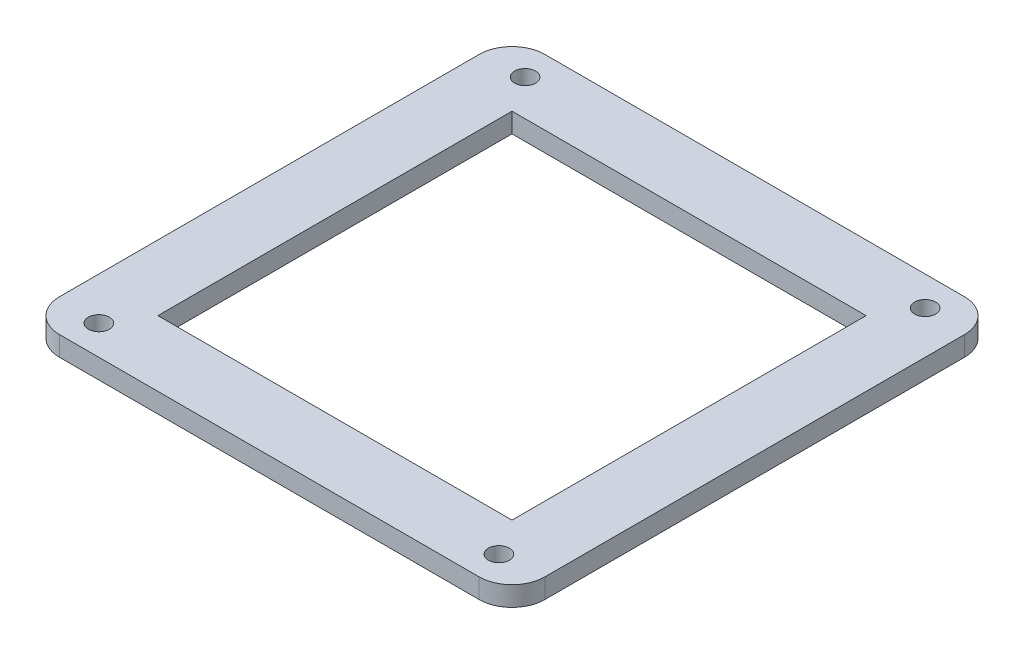
ISO-10303-21;
HEADER;
FILE_DESCRIPTION(('STEP AP214'),'2;1');
FILE_NAME('part.step','',(''),(''),'','','');
FILE_SCHEMA(('AUTOMOTIVE_DESIGN { 1 0 10303 214 1 1 1 1 }'));
ENDSEC;
DATA;
#1=APPLICATION_CONTEXT('core data for automotive mechanical design processes');
#2=APPLICATION_PROTOCOL_DEFINITION('international standard','automotive_design',2000,#1);
#3=PRODUCT_CONTEXT('',#1,'mechanical');
#4=PRODUCT('Part','Part','',(#3));
#5=PRODUCT_RELATED_PRODUCT_CATEGORY('part','',(#4));
#6=PRODUCT_DEFINITION_FORMATION('','',#4);
#7=PRODUCT_DEFINITION_CONTEXT('part definition',#1,'design');
#8=PRODUCT_DEFINITION('design','',#6,#7);
#9=PRODUCT_DEFINITION_SHAPE('','',#8);
#10=(LENGTH_UNIT() NAMED_UNIT(*) SI_UNIT(.MILLI.,.METRE.));
#11=(NAMED_UNIT(*) PLANE_ANGLE_UNIT() SI_UNIT($,.RADIAN.));
#12=(NAMED_UNIT(*) SI_UNIT($,.STERADIAN.) SOLID_ANGLE_UNIT());
#13=UNCERTAINTY_MEASURE_WITH_UNIT(LENGTH_MEASURE(1.E-05),#10,'distance_accuracy_value','');
#14=(GEOMETRIC_REPRESENTATION_CONTEXT(3) GLOBAL_UNCERTAINTY_ASSIGNED_CONTEXT((#13)) GLOBAL_UNIT_ASSIGNED_CONTEXT((#10,
#11,#12)) REPRESENTATION_CONTEXT('',''));
#15=CARTESIAN_POINT('',(0.,0.,0.));
#16=DIRECTION('',(0.,0.,1.));
#17=DIRECTION('',(1.,0.,0.));
#18=AXIS2_PLACEMENT_3D('',#15,#16,#17);
#19=CARTESIAN_POINT('',(0.,3.,0.));
#20=DIRECTION('',(0.,-1.,0.));
#21=DIRECTION('',(0.,0.,-1.));
#22=AXIS2_PLACEMENT_3D('',#19,#20,#21);
#23=PLANE('',#22);
#24=CARTESIAN_POINT('',(-30.5,3.,-32.5));
#25=DIRECTION('',(0.,1.,0.));
#26=DIRECTION('',(0.,0.,1.));
#27=AXIS2_PLACEMENT_3D('',#24,#25,#26);
#28=CIRCLE('',#27,1.6);
#29=CARTESIAN_POINT('',(-30.5,3.,-30.9));
#30=VERTEX_POINT('',#29);
#31=EDGE_CURVE('E417',#30,#30,#28,.T.);
#32=ORIENTED_EDGE('',*,*,#31,.F.);
#33=EDGE_LOOP('',(#32));
#34=FACE_BOUND('',#33,.T.);
#35=CARTESIAN_POINT('',(30.5,3.,-32.5));
#36=DIRECTION('',(0.,1.,0.));
#37=DIRECTION('',(0.,0.,1.));
#38=AXIS2_PLACEMENT_3D('',#35,#36,#37);
#39=CIRCLE('',#38,1.6);
#40=CARTESIAN_POINT('',(30.5,3.,-30.9));
#41=VERTEX_POINT('',#40);
#42=EDGE_CURVE('E419',#41,#41,#39,.T.);
#43=ORIENTED_EDGE('',*,*,#42,.F.);
#44=EDGE_LOOP('',(#43));
#45=FACE_BOUND('',#44,.T.);
#46=CARTESIAN_POINT('',(30.5,3.,32.5));
#47=DIRECTION('',(0.,1.,0.));
#48=DIRECTION('',(0.,0.,1.));
#49=AXIS2_PLACEMENT_3D('',#46,#47,#48);
#50=CIRCLE('',#49,1.6);
#51=CARTESIAN_POINT('',(30.5,3.,34.1));
#52=VERTEX_POINT('',#51);
#53=EDGE_CURVE('E191',#52,#52,#50,.T.);
#54=ORIENTED_EDGE('',*,*,#53,.F.);
#55=EDGE_LOOP('',(#54));
#56=FACE_BOUND('',#55,.T.);
#57=CARTESIAN_POINT('',(-30.5,3.,32.5));
#58=DIRECTION('',(0.,1.,0.));
#59=DIRECTION('',(0.,0.,1.));
#60=AXIS2_PLACEMENT_3D('',#57,#58,#59);
#61=CIRCLE('',#60,1.6);
#62=CARTESIAN_POINT('',(-30.5,3.,34.1));
#63=VERTEX_POINT('',#62);
#64=EDGE_CURVE('E190',#63,#63,#61,.T.);
#65=ORIENTED_EDGE('',*,*,#64,.F.);
#66=EDGE_LOOP('',(#65));
#67=FACE_BOUND('',#66,.T.);
#68=DIRECTION('',(0.,0.,1.));
#69=VECTOR('',#68,1.);
#70=CARTESIAN_POINT('',(-37.,3.,37.));
#71=LINE('',#70,#69);
#72=CARTESIAN_POINT('',(-37.,3.,-32.));
#73=VERTEX_POINT('',#72);
#74=CARTESIAN_POINT('',(-37.,3.,32.));
#75=VERTEX_POINT('',#74);
#76=EDGE_CURVE('E171',#73,#75,#71,.T.);
#77=ORIENTED_EDGE('',*,*,#76,.T.);
#78=CARTESIAN_POINT('',(-32.,3.,32.));
#79=DIRECTION('',(0.,-1.,0.));
#80=DIRECTION('',(0.,0.,-1.));
#81=AXIS2_PLACEMENT_3D('',#78,#79,#80);
#82=CIRCLE('',#81,5.);
#83=CARTESIAN_POINT('',(-32.,3.,37.));
#84=VERTEX_POINT('',#83);
#85=EDGE_CURVE('E214',#75,#84,#82,.F.);
#86=ORIENTED_EDGE('',*,*,#85,.T.);
#87=DIRECTION('',(1.,0.,0.));
#88=VECTOR('',#87,1.);
#89=CARTESIAN_POINT('',(-37.,3.,37.));
#90=LINE('',#89,#88);
#91=CARTESIAN_POINT('',(32.,3.,37.));
#92=VERTEX_POINT('',#91);
#93=EDGE_CURVE('E174',#84,#92,#90,.T.);
#94=ORIENTED_EDGE('',*,*,#93,.T.);
#95=CARTESIAN_POINT('',(32.,3.,32.));
#96=DIRECTION('',(0.,-1.,0.));
#97=DIRECTION('',(0.,0.,-1.));
#98=AXIS2_PLACEMENT_3D('',#95,#96,#97);
#99=CIRCLE('',#98,5.);
#100=CARTESIAN_POINT('',(37.,3.,32.));
#101=VERTEX_POINT('',#100);
#102=EDGE_CURVE('E212',#92,#101,#99,.F.);
#103=ORIENTED_EDGE('',*,*,#102,.T.);
#104=DIRECTION('',(0.,0.,-1.));
#105=VECTOR('',#104,1.);
#106=CARTESIAN_POINT('',(37.,3.,37.));
#107=LINE('',#106,#105);
#108=CARTESIAN_POINT('',(37.,3.,-32.));
#109=VERTEX_POINT('',#108);
#110=EDGE_CURVE('E166',#101,#109,#107,.T.);
#111=ORIENTED_EDGE('',*,*,#110,.T.);
#112=CARTESIAN_POINT('',(32.,3.,-32.));
#113=DIRECTION('',(0.,-1.,0.));
#114=DIRECTION('',(0.,0.,-1.));
#115=AXIS2_PLACEMENT_3D('',#112,#113,#114);
#116=CIRCLE('',#115,5.);
#117=CARTESIAN_POINT('',(32.,3.,-37.));
#118=VERTEX_POINT('',#117);
#119=EDGE_CURVE('E53',#109,#118,#116,.F.);
#120=ORIENTED_EDGE('',*,*,#119,.T.);
#121=DIRECTION('',(-1.,0.,0.));
#122=VECTOR('',#121,1.);
#123=CARTESIAN_POINT('',(-37.,3.,-37.));
#124=LINE('',#123,#122);
#125=CARTESIAN_POINT('',(-32.,3.,-37.));
#126=VERTEX_POINT('',#125);
#127=EDGE_CURVE('E168',#118,#126,#124,.T.);
#128=ORIENTED_EDGE('',*,*,#127,.T.);
#129=CARTESIAN_POINT('',(-32.,3.,-32.));
#130=DIRECTION('',(0.,-1.,0.));
#131=DIRECTION('',(0.,0.,-1.));
#132=AXIS2_PLACEMENT_3D('',#129,#130,#131);
#133=CIRCLE('',#132,5.);
#134=EDGE_CURVE('E209',#126,#73,#133,.F.);
#135=ORIENTED_EDGE('',*,*,#134,.T.);
#136=EDGE_LOOP('',(#77,#86,#94,#103,#111,#120,#128,#135));
#137=FACE_BOUND('',#136,.T.);
#138=DIRECTION('',(0.,0.,1.));
#139=VECTOR('',#138,1.);
#140=CARTESIAN_POINT('',(-27.,3.,27.));
#141=LINE('',#140,#139);
#142=CARTESIAN_POINT('',(-27.,3.,-27.));
#143=VERTEX_POINT('',#142);
#144=CARTESIAN_POINT('',(-27.,3.,27.));
#145=VERTEX_POINT('',#144);
#146=EDGE_CURVE('E123',#143,#145,#141,.T.);
#147=ORIENTED_EDGE('',*,*,#146,.F.);
#148=DIRECTION('',(-1.,0.,0.));
#149=VECTOR('',#148,1.);
#150=CARTESIAN_POINT('',(-27.,3.,-27.));
#151=LINE('',#150,#149);
#152=CARTESIAN_POINT('',(27.,3.,-27.));
#153=VERTEX_POINT('',#152);
#154=EDGE_CURVE('E148',#153,#143,#151,.T.);
#155=ORIENTED_EDGE('',*,*,#154,.F.);
#156=DIRECTION('',(0.,0.,-1.));
#157=VECTOR('',#156,1.);
#158=CARTESIAN_POINT('',(27.,3.,27.));
#159=LINE('',#158,#157);
#160=CARTESIAN_POINT('',(27.,3.,27.));
#161=VERTEX_POINT('',#160);
#162=EDGE_CURVE('E146',#161,#153,#159,.T.);
#163=ORIENTED_EDGE('',*,*,#162,.F.);
#164=DIRECTION('',(1.,0.,0.));
#165=VECTOR('',#164,1.);
#166=CARTESIAN_POINT('',(-27.,3.,27.));
#167=LINE('',#166,#165);
#168=EDGE_CURVE('E133',#145,#161,#167,.T.);
#169=ORIENTED_EDGE('',*,*,#168,.F.);
#170=EDGE_LOOP('',(#147,#155,#163,#169));
#171=FACE_BOUND('',#170,.T.);
#172=ADVANCED_FACE('F32',(#34,#45,#56,#67,#137,#171),#23,.F.);
#173=CARTESIAN_POINT('',(0.,0.,0.));
#174=DIRECTION('',(0.,-1.,0.));
#175=DIRECTION('',(0.,0.,-1.));
#176=AXIS2_PLACEMENT_3D('',#173,#174,#175);
#177=PLANE('',#176);
#178=CARTESIAN_POINT('',(-30.5,0.,-32.5));
#179=DIRECTION('',(0.,-1.,0.));
#180=DIRECTION('',(0.,0.,-1.));
#181=AXIS2_PLACEMENT_3D('',#178,#179,#180);
#182=CIRCLE('',#181,1.6);
#183=CARTESIAN_POINT('',(-30.5,0.,-34.1));
#184=VERTEX_POINT('',#183);
#185=EDGE_CURVE('E415',#184,#184,#182,.T.);
#186=ORIENTED_EDGE('',*,*,#185,.F.);
#187=EDGE_LOOP('',(#186));
#188=FACE_BOUND('',#187,.T.);
#189=CARTESIAN_POINT('',(30.5,0.,-32.5));
#190=DIRECTION('',(0.,-1.,0.));
#191=DIRECTION('',(0.,0.,-1.));
#192=AXIS2_PLACEMENT_3D('',#189,#190,#191);
#193=CIRCLE('',#192,1.6);
#194=CARTESIAN_POINT('',(30.5,0.,-34.1));
#195=VERTEX_POINT('',#194);
#196=EDGE_CURVE('E424',#195,#195,#193,.T.);
#197=ORIENTED_EDGE('',*,*,#196,.F.);
#198=EDGE_LOOP('',(#197));
#199=FACE_BOUND('',#198,.T.);
#200=CARTESIAN_POINT('',(30.5,0.,32.5));
#201=DIRECTION('',(0.,-1.,0.));
#202=DIRECTION('',(0.,0.,-1.));
#203=AXIS2_PLACEMENT_3D('',#200,#201,#202);
#204=CIRCLE('',#203,1.6);
#205=CARTESIAN_POINT('',(30.5,0.,30.9));
#206=VERTEX_POINT('',#205);
#207=EDGE_CURVE('E187',#206,#206,#204,.T.);
#208=ORIENTED_EDGE('',*,*,#207,.F.);
#209=EDGE_LOOP('',(#208));
#210=FACE_BOUND('',#209,.T.);
#211=CARTESIAN_POINT('',(-30.5,0.,32.5));
#212=DIRECTION('',(0.,-1.,0.));
#213=DIRECTION('',(0.,0.,-1.));
#214=AXIS2_PLACEMENT_3D('',#211,#212,#213);
#215=CIRCLE('',#214,1.6);
#216=CARTESIAN_POINT('',(-30.5,0.,30.9));
#217=VERTEX_POINT('',#216);
#218=EDGE_CURVE('E155',#217,#217,#215,.T.);
#219=ORIENTED_EDGE('',*,*,#218,.F.);
#220=EDGE_LOOP('',(#219));
#221=FACE_BOUND('',#220,.T.);
#222=DIRECTION('',(1.,0.,0.));
#223=VECTOR('',#222,1.);
#224=CARTESIAN_POINT('',(-37.,0.,37.));
#225=LINE('',#224,#223);
#226=CARTESIAN_POINT('',(-32.,0.,37.));
#227=VERTEX_POINT('',#226);
#228=CARTESIAN_POINT('',(32.,0.,37.));
#229=VERTEX_POINT('',#228);
#230=EDGE_CURVE('E169',#227,#229,#225,.T.);
#231=ORIENTED_EDGE('',*,*,#230,.F.);
#232=CARTESIAN_POINT('',(-32.,0.,32.));
#233=DIRECTION('',(0.,-1.,0.));
#234=DIRECTION('',(0.,0.,-1.));
#235=AXIS2_PLACEMENT_3D('',#232,#233,#234);
#236=CIRCLE('',#235,5.);
#237=CARTESIAN_POINT('',(-37.,0.,32.));
#238=VERTEX_POINT('',#237);
#239=EDGE_CURVE('E202',#227,#238,#236,.T.);
#240=ORIENTED_EDGE('',*,*,#239,.T.);
#241=DIRECTION('',(0.,0.,1.));
#242=VECTOR('',#241,1.);
#243=CARTESIAN_POINT('',(-37.,0.,37.));
#244=LINE('',#243,#242);
#245=CARTESIAN_POINT('',(-37.,0.,-32.));
#246=VERTEX_POINT('',#245);
#247=EDGE_CURVE('E182',#246,#238,#244,.T.);
#248=ORIENTED_EDGE('',*,*,#247,.F.);
#249=CARTESIAN_POINT('',(-32.,0.,-32.));
#250=DIRECTION('',(0.,-1.,0.));
#251=DIRECTION('',(0.,0.,-1.));
#252=AXIS2_PLACEMENT_3D('',#249,#250,#251);
#253=CIRCLE('',#252,5.);
#254=CARTESIAN_POINT('',(-32.,0.,-37.));
#255=VERTEX_POINT('',#254);
#256=EDGE_CURVE('E196',#246,#255,#253,.T.);
#257=ORIENTED_EDGE('',*,*,#256,.T.);
#258=DIRECTION('',(-1.,0.,0.));
#259=VECTOR('',#258,1.);
#260=CARTESIAN_POINT('',(-37.,0.,-37.));
#261=LINE('',#260,#259);
#262=CARTESIAN_POINT('',(32.,0.,-37.));
#263=VERTEX_POINT('',#262);
#264=EDGE_CURVE('E180',#263,#255,#261,.T.);
#265=ORIENTED_EDGE('',*,*,#264,.F.);
#266=CARTESIAN_POINT('',(32.,0.,-32.));
#267=DIRECTION('',(0.,-1.,0.));
#268=DIRECTION('',(0.,0.,-1.));
#269=AXIS2_PLACEMENT_3D('',#266,#267,#268);
#270=CIRCLE('',#269,5.);
#271=CARTESIAN_POINT('',(37.,0.,-32.));
#272=VERTEX_POINT('',#271);
#273=EDGE_CURVE('E198',#263,#272,#270,.T.);
#274=ORIENTED_EDGE('',*,*,#273,.T.);
#275=DIRECTION('',(0.,0.,-1.));
#276=VECTOR('',#275,1.);
#277=CARTESIAN_POINT('',(37.,0.,37.));
#278=LINE('',#277,#276);
#279=CARTESIAN_POINT('',(37.,0.,32.));
#280=VERTEX_POINT('',#279);
#281=EDGE_CURVE('E141',#280,#272,#278,.T.);
#282=ORIENTED_EDGE('',*,*,#281,.F.);
#283=CARTESIAN_POINT('',(32.,0.,32.));
#284=DIRECTION('',(0.,-1.,0.));
#285=DIRECTION('',(0.,0.,-1.));
#286=AXIS2_PLACEMENT_3D('',#283,#284,#285);
#287=CIRCLE('',#286,5.);
#288=EDGE_CURVE('E200',#280,#229,#287,.T.);
#289=ORIENTED_EDGE('',*,*,#288,.T.);
#290=EDGE_LOOP('',(#231,#240,#248,#257,#265,#274,#282,#289));
#291=FACE_BOUND('',#290,.T.);
#292=DIRECTION('',(-1.,0.,0.));
#293=VECTOR('',#292,1.);
#294=CARTESIAN_POINT('',(-27.,0.,-27.));
#295=LINE('',#294,#293);
#296=CARTESIAN_POINT('',(27.,0.,-27.));
#297=VERTEX_POINT('',#296);
#298=CARTESIAN_POINT('',(-27.,0.,-27.));
#299=VERTEX_POINT('',#298);
#300=EDGE_CURVE('E134',#297,#299,#295,.T.);
#301=ORIENTED_EDGE('',*,*,#300,.T.);
#302=DIRECTION('',(0.,0.,1.));
#303=VECTOR('',#302,1.);
#304=CARTESIAN_POINT('',(-27.,0.,27.));
#305=LINE('',#304,#303);
#306=CARTESIAN_POINT('',(-27.,0.,27.));
#307=VERTEX_POINT('',#306);
#308=EDGE_CURVE('E153',#299,#307,#305,.T.);
#309=ORIENTED_EDGE('',*,*,#308,.T.);
#310=DIRECTION('',(1.,0.,0.));
#311=VECTOR('',#310,1.);
#312=CARTESIAN_POINT('',(-27.,0.,27.));
#313=LINE('',#312,#311);
#314=CARTESIAN_POINT('',(27.,0.,27.));
#315=VERTEX_POINT('',#314);
#316=EDGE_CURVE('E140',#307,#315,#313,.T.);
#317=ORIENTED_EDGE('',*,*,#316,.T.);
#318=DIRECTION('',(0.,0.,-1.));
#319=VECTOR('',#318,1.);
#320=CARTESIAN_POINT('',(27.,0.,27.));
#321=LINE('',#320,#319);
#322=EDGE_CURVE('E157',#315,#297,#321,.T.);
#323=ORIENTED_EDGE('',*,*,#322,.T.);
#324=EDGE_LOOP('',(#301,#309,#317,#323));
#325=FACE_BOUND('',#324,.T.);
#326=ADVANCED_FACE('F230',(#188,#199,#210,#221,#291,#325),#177,.T.);
#327=CARTESIAN_POINT('',(37.,3.,37.));
#328=DIRECTION('',(-1.,0.,0.));
#329=DIRECTION('',(0.,0.,1.));
#330=AXIS2_PLACEMENT_3D('',#327,#328,#329);
#331=PLANE('',#330);
#332=ORIENTED_EDGE('',*,*,#110,.F.);
#333=DIRECTION('',(0.,-1.,0.));
#334=VECTOR('',#333,1.);
#335=CARTESIAN_POINT('',(37.,3.,32.));
#336=LINE('',#335,#334);
#337=EDGE_CURVE('E218',#101,#280,#336,.T.);
#338=ORIENTED_EDGE('',*,*,#337,.T.);
#339=ORIENTED_EDGE('',*,*,#281,.T.);
#340=DIRECTION('',(0.,-1.,0.));
#341=VECTOR('',#340,1.);
#342=CARTESIAN_POINT('',(37.,3.,-32.));
#343=LINE('',#342,#341);
#344=EDGE_CURVE('E216',#272,#109,#343,.F.);
#345=ORIENTED_EDGE('',*,*,#344,.T.);
#346=EDGE_LOOP('',(#332,#338,#339,#345));
#347=FACE_BOUND('',#346,.T.);
#348=ADVANCED_FACE('F224',(#347),#331,.F.);
#349=CARTESIAN_POINT('',(-37.,3.,-37.));
#350=DIRECTION('',(0.,0.,1.));
#351=DIRECTION('',(1.,0.,0.));
#352=AXIS2_PLACEMENT_3D('',#349,#350,#351);
#353=PLANE('',#352);
#354=ORIENTED_EDGE('',*,*,#127,.F.);
#355=DIRECTION('',(0.,-1.,0.));
#356=VECTOR('',#355,1.);
#357=CARTESIAN_POINT('',(32.,3.,-37.));
#358=LINE('',#357,#356);
#359=EDGE_CURVE('E11',#118,#263,#358,.T.);
#360=ORIENTED_EDGE('',*,*,#359,.T.);
#361=ORIENTED_EDGE('',*,*,#264,.T.);
#362=DIRECTION('',(0.,-1.,0.));
#363=VECTOR('',#362,1.);
#364=CARTESIAN_POINT('',(-32.,3.,-37.));
#365=LINE('',#364,#363);
#366=EDGE_CURVE('E40',#255,#126,#365,.F.);
#367=ORIENTED_EDGE('',*,*,#366,.T.);
#368=EDGE_LOOP('',(#354,#360,#361,#367));
#369=FACE_BOUND('',#368,.T.);
#370=ADVANCED_FACE('F236',(#369),#353,.F.);
#371=CARTESIAN_POINT('',(-37.,3.,37.));
#372=DIRECTION('',(1.,0.,0.));
#373=DIRECTION('',(0.,0.,-1.));
#374=AXIS2_PLACEMENT_3D('',#371,#372,#373);
#375=PLANE('',#374);
#376=ORIENTED_EDGE('',*,*,#247,.T.);
#377=DIRECTION('',(0.,-1.,0.));
#378=VECTOR('',#377,1.);
#379=CARTESIAN_POINT('',(-37.,3.,32.));
#380=LINE('',#379,#378);
#381=EDGE_CURVE('E207',#238,#75,#380,.F.);
#382=ORIENTED_EDGE('',*,*,#381,.T.);
#383=ORIENTED_EDGE('',*,*,#76,.F.);
#384=DIRECTION('',(0.,-1.,0.));
#385=VECTOR('',#384,1.);
#386=CARTESIAN_POINT('',(-37.,3.,-32.));
#387=LINE('',#386,#385);
#388=EDGE_CURVE('E204',#73,#246,#387,.T.);
#389=ORIENTED_EDGE('',*,*,#388,.T.);
#390=EDGE_LOOP('',(#376,#382,#383,#389));
#391=FACE_BOUND('',#390,.T.);
#392=ADVANCED_FACE('F243',(#391),#375,.F.);
#393=CARTESIAN_POINT('',(-37.,3.,37.));
#394=DIRECTION('',(0.,0.,-1.));
#395=DIRECTION('',(-1.,0.,0.));
#396=AXIS2_PLACEMENT_3D('',#393,#394,#395);
#397=PLANE('',#396);
#398=ORIENTED_EDGE('',*,*,#93,.F.);
#399=DIRECTION('',(0.,-1.,0.));
#400=VECTOR('',#399,1.);
#401=CARTESIAN_POINT('',(-32.,3.,37.));
#402=LINE('',#401,#400);
#403=EDGE_CURVE('E193',#84,#227,#402,.T.);
#404=ORIENTED_EDGE('',*,*,#403,.T.);
#405=ORIENTED_EDGE('',*,*,#230,.T.);
#406=DIRECTION('',(0.,-1.,0.));
#407=VECTOR('',#406,1.);
#408=CARTESIAN_POINT('',(32.,3.,37.));
#409=LINE('',#408,#407);
#410=EDGE_CURVE('E177',#229,#92,#409,.F.);
#411=ORIENTED_EDGE('',*,*,#410,.T.);
#412=EDGE_LOOP('',(#398,#404,#405,#411));
#413=FACE_BOUND('',#412,.T.);
#414=ADVANCED_FACE('F251',(#413),#397,.F.);
#415=CARTESIAN_POINT('',(-27.,3.,27.));
#416=DIRECTION('',(1.,0.,0.));
#417=DIRECTION('',(0.,0.,-1.));
#418=AXIS2_PLACEMENT_3D('',#415,#416,#417);
#419=PLANE('',#418);
#420=ORIENTED_EDGE('',*,*,#308,.F.);
#421=DIRECTION('',(0.,-1.,0.));
#422=VECTOR('',#421,1.);
#423=CARTESIAN_POINT('',(-27.,3.,-27.));
#424=LINE('',#423,#422);
#425=EDGE_CURVE('E129',#143,#299,#424,.T.);
#426=ORIENTED_EDGE('',*,*,#425,.F.);
#427=ORIENTED_EDGE('',*,*,#146,.T.);
#428=DIRECTION('',(0.,-1.,0.));
#429=VECTOR('',#428,1.);
#430=CARTESIAN_POINT('',(-27.,3.,27.));
#431=LINE('',#430,#429);
#432=EDGE_CURVE('E126',#145,#307,#431,.T.);
#433=ORIENTED_EDGE('',*,*,#432,.T.);
#434=EDGE_LOOP('',(#420,#426,#427,#433));
#435=FACE_BOUND('',#434,.T.);
#436=ADVANCED_FACE('F125',(#435),#419,.T.);
#437=CARTESIAN_POINT('',(-27.,3.,27.));
#438=DIRECTION('',(0.,0.,-1.));
#439=DIRECTION('',(-1.,0.,0.));
#440=AXIS2_PLACEMENT_3D('',#437,#438,#439);
#441=PLANE('',#440);
#442=ORIENTED_EDGE('',*,*,#316,.F.);
#443=ORIENTED_EDGE('',*,*,#432,.F.);
#444=ORIENTED_EDGE('',*,*,#168,.T.);
#445=DIRECTION('',(0.,-1.,0.));
#446=VECTOR('',#445,1.);
#447=CARTESIAN_POINT('',(27.,3.,27.));
#448=LINE('',#447,#446);
#449=EDGE_CURVE('E142',#161,#315,#448,.T.);
#450=ORIENTED_EDGE('',*,*,#449,.T.);
#451=EDGE_LOOP('',(#442,#443,#444,#450));
#452=FACE_BOUND('',#451,.T.);
#453=ADVANCED_FACE('F137',(#452),#441,.T.);
#454=CARTESIAN_POINT('',(27.,3.,27.));
#455=DIRECTION('',(-1.,0.,0.));
#456=DIRECTION('',(0.,0.,1.));
#457=AXIS2_PLACEMENT_3D('',#454,#455,#456);
#458=PLANE('',#457);
#459=ORIENTED_EDGE('',*,*,#322,.F.);
#460=ORIENTED_EDGE('',*,*,#449,.F.);
#461=ORIENTED_EDGE('',*,*,#162,.T.);
#462=DIRECTION('',(0.,-1.,0.));
#463=VECTOR('',#462,1.);
#464=CARTESIAN_POINT('',(27.,3.,-27.));
#465=LINE('',#464,#463);
#466=EDGE_CURVE('E163',#153,#297,#465,.T.);
#467=ORIENTED_EDGE('',*,*,#466,.T.);
#468=EDGE_LOOP('',(#459,#460,#461,#467));
#469=FACE_BOUND('',#468,.T.);
#470=ADVANCED_FACE('F310',(#469),#458,.T.);
#471=CARTESIAN_POINT('',(-27.,3.,-27.));
#472=DIRECTION('',(0.,0.,1.));
#473=DIRECTION('',(1.,0.,0.));
#474=AXIS2_PLACEMENT_3D('',#471,#472,#473);
#475=PLANE('',#474);
#476=ORIENTED_EDGE('',*,*,#300,.F.);
#477=ORIENTED_EDGE('',*,*,#466,.F.);
#478=ORIENTED_EDGE('',*,*,#154,.T.);
#479=ORIENTED_EDGE('',*,*,#425,.T.);
#480=EDGE_LOOP('',(#476,#477,#478,#479));
#481=FACE_BOUND('',#480,.T.);
#482=ADVANCED_FACE('F316',(#481),#475,.T.);
#483=CARTESIAN_POINT('',(-30.5,3.,32.5));
#484=DIRECTION('',(0.,1.,0.));
#485=DIRECTION('',(0.,0.,1.));
#486=AXIS2_PLACEMENT_3D('',#483,#484,#485);
#487=CYLINDRICAL_SURFACE('',#486,1.6);
#488=ORIENTED_EDGE('',*,*,#218,.T.);
#489=EDGE_LOOP('',(#488));
#490=FACE_BOUND('',#489,.T.);
#491=ORIENTED_EDGE('',*,*,#64,.T.);
#492=EDGE_LOOP('',(#491));
#493=FACE_BOUND('',#492,.T.);
#494=ADVANCED_FACE('F324',(#490,#493),#487,.F.);
#495=CARTESIAN_POINT('',(30.5,3.,32.5));
#496=DIRECTION('',(0.,1.,0.));
#497=DIRECTION('',(0.,0.,1.));
#498=AXIS2_PLACEMENT_3D('',#495,#496,#497);
#499=CYLINDRICAL_SURFACE('',#498,1.6);
#500=ORIENTED_EDGE('',*,*,#207,.T.);
#501=EDGE_LOOP('',(#500));
#502=FACE_BOUND('',#501,.T.);
#503=ORIENTED_EDGE('',*,*,#53,.T.);
#504=EDGE_LOOP('',(#503));
#505=FACE_BOUND('',#504,.T.);
#506=ADVANCED_FACE('F332',(#502,#505),#499,.F.);
#507=CARTESIAN_POINT('',(30.5,3.,-32.5));
#508=DIRECTION('',(0.,1.,0.));
#509=DIRECTION('',(0.,0.,1.));
#510=AXIS2_PLACEMENT_3D('',#507,#508,#509);
#511=CYLINDRICAL_SURFACE('',#510,1.6);
#512=ORIENTED_EDGE('',*,*,#196,.T.);
#513=EDGE_LOOP('',(#512));
#514=FACE_BOUND('',#513,.T.);
#515=ORIENTED_EDGE('',*,*,#42,.T.);
#516=EDGE_LOOP('',(#515));
#517=FACE_BOUND('',#516,.T.);
#518=ADVANCED_FACE('F340',(#514,#517),#511,.F.);
#519=CARTESIAN_POINT('',(-30.5,3.,-32.5));
#520=DIRECTION('',(0.,1.,0.));
#521=DIRECTION('',(0.,0.,1.));
#522=AXIS2_PLACEMENT_3D('',#519,#520,#521);
#523=CYLINDRICAL_SURFACE('',#522,1.6);
#524=ORIENTED_EDGE('',*,*,#185,.T.);
#525=EDGE_LOOP('',(#524));
#526=FACE_BOUND('',#525,.T.);
#527=ORIENTED_EDGE('',*,*,#31,.T.);
#528=EDGE_LOOP('',(#527));
#529=FACE_BOUND('',#528,.T.);
#530=ADVANCED_FACE('F260',(#526,#529),#523,.F.);
#531=CARTESIAN_POINT('',(-32.,3.,32.));
#532=DIRECTION('',(0.,-1.,0.));
#533=DIRECTION('',(0.,0.,-1.));
#534=AXIS2_PLACEMENT_3D('',#531,#532,#533);
#535=CYLINDRICAL_SURFACE('',#534,5.);
#536=ORIENTED_EDGE('',*,*,#85,.F.);
#537=ORIENTED_EDGE('',*,*,#381,.F.);
#538=ORIENTED_EDGE('',*,*,#239,.F.);
#539=ORIENTED_EDGE('',*,*,#403,.F.);
#540=EDGE_LOOP('',(#536,#537,#538,#539));
#541=FACE_BOUND('',#540,.T.);
#542=ADVANCED_FACE('F248',(#541),#535,.T.);
#543=CARTESIAN_POINT('',(32.,3.,32.));
#544=DIRECTION('',(0.,-1.,0.));
#545=DIRECTION('',(0.,0.,-1.));
#546=AXIS2_PLACEMENT_3D('',#543,#544,#545);
#547=CYLINDRICAL_SURFACE('',#546,5.);
#548=ORIENTED_EDGE('',*,*,#102,.F.);
#549=ORIENTED_EDGE('',*,*,#410,.F.);
#550=ORIENTED_EDGE('',*,*,#288,.F.);
#551=ORIENTED_EDGE('',*,*,#337,.F.);
#552=EDGE_LOOP('',(#548,#549,#550,#551));
#553=FACE_BOUND('',#552,.T.);
#554=ADVANCED_FACE('F253',(#553),#547,.T.);
#555=CARTESIAN_POINT('',(32.,3.,-32.));
#556=DIRECTION('',(0.,-1.,0.));
#557=DIRECTION('',(0.,0.,-1.));
#558=AXIS2_PLACEMENT_3D('',#555,#556,#557);
#559=CYLINDRICAL_SURFACE('',#558,5.);
#560=ORIENTED_EDGE('',*,*,#119,.F.);
#561=ORIENTED_EDGE('',*,*,#344,.F.);
#562=ORIENTED_EDGE('',*,*,#273,.F.);
#563=ORIENTED_EDGE('',*,*,#359,.F.);
#564=EDGE_LOOP('',(#560,#561,#562,#563));
#565=FACE_BOUND('',#564,.T.);
#566=ADVANCED_FACE('F235',(#565),#559,.T.);
#567=CARTESIAN_POINT('',(-32.,3.,-32.));
#568=DIRECTION('',(0.,-1.,0.));
#569=DIRECTION('',(0.,0.,-1.));
#570=AXIS2_PLACEMENT_3D('',#567,#568,#569);
#571=CYLINDRICAL_SURFACE('',#570,5.);
#572=ORIENTED_EDGE('',*,*,#134,.F.);
#573=ORIENTED_EDGE('',*,*,#366,.F.);
#574=ORIENTED_EDGE('',*,*,#256,.F.);
#575=ORIENTED_EDGE('',*,*,#388,.F.);
#576=EDGE_LOOP('',(#572,#573,#574,#575));
#577=FACE_BOUND('',#576,.T.);
#578=ADVANCED_FACE('F34',(#577),#571,.T.);
#579=CLOSED_SHELL('',(#172,#326,#348,#370,#392,#414,#436,#453,#470,#482,#494,#506,#518,#530,
#542,#554,#566,#578));
#580=MANIFOLD_SOLID_BREP('B2',#579);
#581=ADVANCED_BREP_SHAPE_REPRESENTATION('',(#18,#580),#14);
#582=SHAPE_DEFINITION_REPRESENTATION(#9,#581);
ENDSEC;
END-ISO-10303-21;
